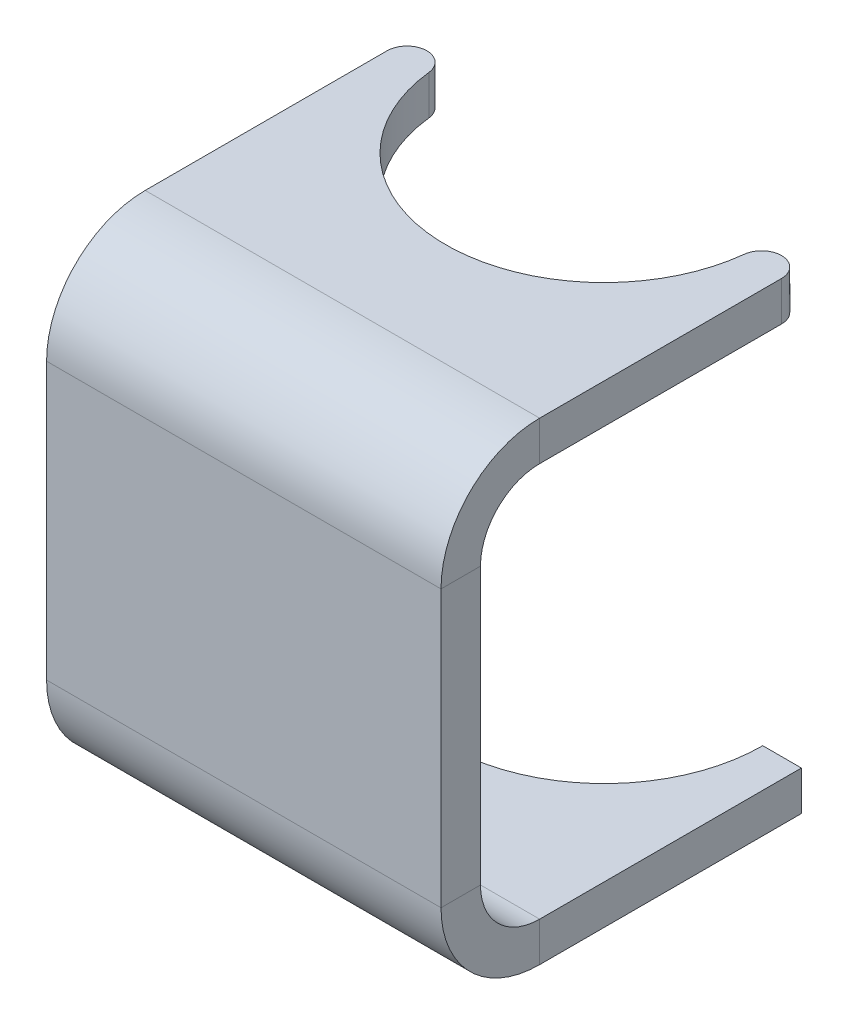
ISO-10303-21;
HEADER;
FILE_DESCRIPTION(('STEP AP214'),'2;1');
FILE_NAME('part.step','',(''),(''),'','','');
FILE_SCHEMA(('AUTOMOTIVE_DESIGN { 1 0 10303 214 1 1 1 1 }'));
ENDSEC;
DATA;
#1=APPLICATION_CONTEXT('core data for automotive mechanical design processes');
#2=APPLICATION_PROTOCOL_DEFINITION('international standard','automotive_design',2000,#1);
#3=PRODUCT_CONTEXT('',#1,'mechanical');
#4=PRODUCT('Part','Part','',(#3));
#5=PRODUCT_RELATED_PRODUCT_CATEGORY('part','',(#4));
#6=PRODUCT_DEFINITION_FORMATION('','',#4);
#7=PRODUCT_DEFINITION_CONTEXT('part definition',#1,'design');
#8=PRODUCT_DEFINITION('design','',#6,#7);
#9=PRODUCT_DEFINITION_SHAPE('','',#8);
#10=(LENGTH_UNIT() NAMED_UNIT(*) SI_UNIT(.MILLI.,.METRE.));
#11=(NAMED_UNIT(*) PLANE_ANGLE_UNIT() SI_UNIT($,.RADIAN.));
#12=(NAMED_UNIT(*) SI_UNIT($,.STERADIAN.) SOLID_ANGLE_UNIT());
#13=UNCERTAINTY_MEASURE_WITH_UNIT(LENGTH_MEASURE(1.E-05),#10,'distance_accuracy_value','');
#14=(GEOMETRIC_REPRESENTATION_CONTEXT(3) GLOBAL_UNCERTAINTY_ASSIGNED_CONTEXT((#13)) GLOBAL_UNIT_ASSIGNED_CONTEXT((#10,
#11,#12)) REPRESENTATION_CONTEXT('',''));
#15=CARTESIAN_POINT('',(0.,0.,0.));
#16=DIRECTION('',(0.,0.,1.));
#17=DIRECTION('',(1.,0.,0.));
#18=AXIS2_PLACEMENT_3D('',#15,#16,#17);
#19=CARTESIAN_POINT('',(15.875,15.5575000000001,-52.8094011308138));
#20=CARTESIAN_POINT('',(15.875,15.6633333333336,-52.8094011308149));
#21=CARTESIAN_POINT('',(15.875,15.7691666666666,-52.8094011306934));
#22=CARTESIAN_POINT('',(15.875,16.9333333333345,-52.8094011307177));
#23=CARTESIAN_POINT('',(15.875,17.991666666664,-52.8094011308602));
#24=CARTESIAN_POINT('',(15.875,19.1558333333337,-52.8094011308844));
#25=CARTESIAN_POINT('',(15.875,19.2616666666665,-52.8094011308818));
#26=CARTESIAN_POINT('',(15.875,19.3675000000001,-52.8094011308829));
#27=CARTESIAN_POINT('',(15.8750000000818,15.5575000000001,-55.6845055560318));
#28=CARTESIAN_POINT('',(15.8750000000809,15.6633333333336,-55.6845055560325));
#29=CARTESIAN_POINT('',(15.8750000002235,15.7691666666663,-55.6845055561596));
#30=CARTESIAN_POINT('',(15.8750000001932,16.9333333333043,-55.6845055561313));
#31=CARTESIAN_POINT('',(15.8750000000289,17.991666666664,-55.6845055559849));
#32=CARTESIAN_POINT('',(15.8749999999986,19.1558333333337,-55.6845055559567));
#33=CARTESIAN_POINT('',(15.8750000000014,19.2616666666665,-55.6845055559581));
#34=CARTESIAN_POINT('',(15.8750000000005,19.3675000000001,-55.6845055559585));
#35=CARTESIAN_POINT('',(13.0043748022879,15.5575000000001,-55.8449313320533));
#36=CARTESIAN_POINT('',(13.0043748022864,15.6633333333336,-55.8449313320537));
#37=CARTESIAN_POINT('',(13.004374802209,15.7691666666663,-55.8449313322153));
#38=CARTESIAN_POINT('',(13.0043748022272,16.9333333333043,-55.844931332183));
#39=CARTESIAN_POINT('',(13.0043748023171,17.9916666666622,-55.8449313319905));
#40=CARTESIAN_POINT('',(13.0043748023342,19.1558333333339,-55.8449313319582));
#41=CARTESIAN_POINT('',(13.004374802332,19.2616666666664,-55.8449313319594));
#42=CARTESIAN_POINT('',(13.0043748023331,19.3675000000001,-55.8449313319601));
#43=CARTESIAN_POINT('',(12.6840231163649,15.5575000000001,-52.9877298597671));
#44=CARTESIAN_POINT('',(12.6840231163649,15.6633333333336,-52.9877298597671));
#45=CARTESIAN_POINT('',(12.6840231163542,15.7691666666666,-52.987729859672));
#46=CARTESIAN_POINT('',(12.6840231163565,16.9333333333345,-52.987729859692));
#47=CARTESIAN_POINT('',(12.6840231163689,17.9916666666622,-52.9877298598028));
#48=CARTESIAN_POINT('',(12.6840231163711,19.1558333333339,-52.9877298598229));
#49=CARTESIAN_POINT('',(12.6840231163708,19.2616666666664,-52.9877298598202));
#50=CARTESIAN_POINT('',(12.684023116371,19.3675000000001,-52.9877298598217));
#51=(BOUNDED_SURFACE() B_SPLINE_SURFACE(3,3,((#19,#20,#21,#22,#23,#24,#25,#26),(#27,#28,#29,#30,
#31,#32,#33,#34),(#35,#36,#37,#38,#39,#40,#41,#42),(#43,#44,#45,#46,#47,#48,#49,#50)),
.UNSPECIFIED.,.F.,.F.,.F.) B_SPLINE_SURFACE_WITH_KNOTS((4,4),(4,2,2,4),(0.,1.),
(-0.0999999999999892,0.,1.,1.1),
.UNSPECIFIED.) GEOMETRIC_REPRESENTATION_ITEM() RATIONAL_B_SPLINE_SURFACE(((1.,1.,1.,1.,1.,1.,1.,
1.),(0.370532162132682,0.370532162132682,0.370532162104608,0.370532162116241,0.370532162148339,
0.370532162148339,0.370532162148506,0.370532162148506),(0.370532162132682,0.370532162132682,
0.370532162104608,0.370532162116241,0.370532162148339,0.370532162148339,0.370532162148506,
0.370532162148506),(1.,1.,1.,1.,1.,1.,1.,1.))) REPRESENTATION_ITEM('') SURFACE());
#52=CARTESIAN_POINT('',(12.6840231163649,15.5575000000001,-52.9877298597671));
#53=CARTESIAN_POINT('',(12.6840231163649,15.6633333333336,-52.9877298597671));
#54=CARTESIAN_POINT('',(12.6840231163542,15.7691666666666,-52.987729859672));
#55=CARTESIAN_POINT('',(12.6840231163565,16.9333333333345,-52.987729859692));
#56=CARTESIAN_POINT('',(12.6840231163689,17.9916666666622,-52.9877298598028));
#57=CARTESIAN_POINT('',(12.6840231163711,19.1558333333339,-52.9877298598229));
#58=CARTESIAN_POINT('',(12.6840231163708,19.2616666666664,-52.9877298598202));
#59=CARTESIAN_POINT('',(12.684023116371,19.3675000000001,-52.9877298598217));
#60=(BOUNDED_CURVE() B_SPLINE_CURVE(3,(#52,#53,#54,#55,#56,#57,#58,#59),.UNSPECIFIED.,.F.,
.F.) B_SPLINE_CURVE_WITH_KNOTS((4,2,2,4),(-0.0999999999999892,0.,1.,1.1),
.UNSPECIFIED.) CURVE() GEOMETRIC_REPRESENTATION_ITEM() RATIONAL_B_SPLINE_CURVE((1.,1.,1.,1.,1.,
1.,1.,1.)) REPRESENTATION_ITEM(''));
#61=CARTESIAN_POINT('',(12.6840231163709,19.0500000000001,-52.9877298598211));
#62=VERTEX_POINT('',#61);
#63=CARTESIAN_POINT('',(12.6840231163544,15.8750000000001,-52.9877298596738));
#64=VERTEX_POINT('',#63);
#65=EDGE_CURVE('E505',#62,#64,#60,.F.);
#66=CARTESIAN_POINT('',(12.6840231163709,19.0500000000001,-52.9877298598211));
#67=CARTESIAN_POINT('',(13.0043748023327,19.0500000000001,-55.8449313319611));
#68=CARTESIAN_POINT('',(15.8750000000013,19.0500000000001,-55.6845055559592));
#69=CARTESIAN_POINT('',(15.875,19.0500000000001,-52.8094011308822));
#70=(BOUNDED_CURVE() B_SPLINE_CURVE(3,(#66,#67,#68,#69),.UNSPECIFIED.,.F.,
.F.) B_SPLINE_CURVE_WITH_KNOTS((4,4),(0.,1.),
.UNSPECIFIED.) CURVE() GEOMETRIC_REPRESENTATION_ITEM() RATIONAL_B_SPLINE_CURVE((1.,
0.370532162148339,0.370532162148339,1.)) REPRESENTATION_ITEM(''));
#71=CARTESIAN_POINT('',(15.875,19.0500000000001,-52.8094011308822));
#72=VERTEX_POINT('',#71);
#73=EDGE_CURVE('E486',#72,#62,#70,.F.);
#74=CARTESIAN_POINT('',(15.875,19.3675000000001,-52.8094011308829));
#75=CARTESIAN_POINT('',(15.875,19.2616666666665,-52.8094011308818));
#76=CARTESIAN_POINT('',(15.875,19.1558333333337,-52.8094011308844));
#77=CARTESIAN_POINT('',(15.875,17.991666666664,-52.8094011308602));
#78=CARTESIAN_POINT('',(15.875,16.9333333333345,-52.8094011307177));
#79=CARTESIAN_POINT('',(15.875,15.7691666666666,-52.8094011306934));
#80=CARTESIAN_POINT('',(15.875,15.6633333333336,-52.8094011308149));
#81=CARTESIAN_POINT('',(15.875,15.5575000000001,-52.8094011308138));
#82=(BOUNDED_CURVE() B_SPLINE_CURVE(3,(#74,#75,#76,#77,#78,#79,#80,#81),.UNSPECIFIED.,.F.,
.F.) B_SPLINE_CURVE_WITH_KNOTS((4,2,2,4),(-0.0999999999999892,0.,1.,1.1),
.UNSPECIFIED.) CURVE() GEOMETRIC_REPRESENTATION_ITEM() RATIONAL_B_SPLINE_CURVE((1.,1.,1.,1.,1.,
1.,1.,1.)) REPRESENTATION_ITEM(''));
#83=CARTESIAN_POINT('',(15.875,15.8750000000001,-52.8094011306956));
#84=VERTEX_POINT('',#83);
#85=EDGE_CURVE('E325',#84,#72,#82,.F.);
#86=CARTESIAN_POINT('',(15.875,15.8750000000001,-52.8094011306956));
#87=CARTESIAN_POINT('',(15.8750000002207,15.8750000000001,-55.684505556157));
#88=CARTESIAN_POINT('',(13.0043748022106,15.8750000000001,-55.8449313322124));
#89=CARTESIAN_POINT('',(12.6840231163544,15.8750000000001,-52.9877298596738));
#90=(BOUNDED_CURVE() B_SPLINE_CURVE(3,(#86,#87,#88,#89),.UNSPECIFIED.,.F.,
.F.) B_SPLINE_CURVE_WITH_KNOTS((4,4),(0.,1.),
.UNSPECIFIED.) CURVE() GEOMETRIC_REPRESENTATION_ITEM() RATIONAL_B_SPLINE_CURVE((1.,
0.370532162105666,0.370532162105666,1.)) REPRESENTATION_ITEM(''));
#91=EDGE_CURVE('E465',#64,#84,#90,.F.);
#92=ORIENTED_EDGE('',*,*,#65,.F.);
#93=ORIENTED_EDGE('',*,*,#73,.F.);
#94=ORIENTED_EDGE('',*,*,#85,.F.);
#95=ORIENTED_EDGE('',*,*,#91,.F.);
#96=EDGE_LOOP('',(#92,#93,#94,#95));
#97=FACE_BOUND('',#96,.T.);
#98=ADVANCED_FACE('F87',(#97),#51,.T.);
#99=CARTESIAN_POINT('',(-15.875,19.3675,-52.8094011308833));
#100=CARTESIAN_POINT('',(-15.875,19.2616666666665,-52.8094011308036));
#101=CARTESIAN_POINT('',(-15.875,19.1558333333337,-52.8094011309626));
#102=CARTESIAN_POINT('',(-15.875,17.991666666664,-52.8094011300902));
#103=CARTESIAN_POINT('',(-15.875,16.9333333333363,-52.8094011239826));
#104=CARTESIAN_POINT('',(-15.875,15.7691666666665,-52.8094011231101));
#105=CARTESIAN_POINT('',(-15.875,15.6633333333347,-52.8094011281098));
#106=CARTESIAN_POINT('',(-15.875,15.5575000000006,-52.8094011280305));
#107=CARTESIAN_POINT('',(-15.875,19.3675000000001,-55.6845055559581));
#108=CARTESIAN_POINT('',(-15.8750000000942,19.2616666666665,-55.6845055560385));
#109=CARTESIAN_POINT('',(-15.8749999999069,19.1558333333233,-55.6845055558736));
#110=CARTESIAN_POINT('',(-15.8750000009308,17.9916666656205,-55.6845055568026));
#111=CARTESIAN_POINT('',(-15.8750000081149,16.9333333323012,-55.6845055632712));
#112=CARTESIAN_POINT('',(-15.8750000091388,15.7691666666561,-55.6845055641962));
#113=CARTESIAN_POINT('',(-15.8750000032605,15.6633333333347,-55.6845055588985));
#114=CARTESIAN_POINT('',(-15.8750000033541,15.5575000000006,-55.6845055589815));
#115=CARTESIAN_POINT('',(-13.0043748023334,19.3675000000001,-55.8449313319596));
#116=CARTESIAN_POINT('',(-13.0043748022836,19.2616666666664,-55.844931332065));
#117=CARTESIAN_POINT('',(-13.0043748023865,19.1558333333235,-55.8449313318535));
#118=CARTESIAN_POINT('',(-13.0043748018019,17.9916666656186,-55.8449313330208));
#119=CARTESIAN_POINT('',(-13.0043747978229,16.9333333323012,-55.8449313412512));
#120=CARTESIAN_POINT('',(-13.0043747972504,15.7691666666561,-55.8449313424265));
#121=CARTESIAN_POINT('',(-13.0043748005173,15.6633333333347,-55.8449313356942));
#122=CARTESIAN_POINT('',(-13.0043748004679,15.5575000000006,-55.8449313358011));
#123=CARTESIAN_POINT('',(-12.684023116371,19.3675,-52.987729859822));
#124=CARTESIAN_POINT('',(-12.6840231163641,19.2616666666664,-52.987729859761));
#125=CARTESIAN_POINT('',(-12.6840231163781,19.1558333333339,-52.9877298598855));
#126=CARTESIAN_POINT('',(-12.6840231162998,17.9916666666622,-52.9877298591868));
#127=CARTESIAN_POINT('',(-12.6840231157603,16.9333333333382,-52.9877298543751));
#128=CARTESIAN_POINT('',(-12.6840231156828,15.7691666666663,-52.9877298536843));
#129=CARTESIAN_POINT('',(-12.6840231161253,15.6633333333348,-52.9877298576304));
#130=CARTESIAN_POINT('',(-12.6840231161184,15.5575000000006,-52.9877298575695));
#131=(BOUNDED_SURFACE() B_SPLINE_SURFACE(3,3,((#99,#100,#101,#102,#103,#104,#105,#106),(#107,
#108,#109,#110,#111,#112,#113,#114),(#115,#116,#117,#118,#119,#120,#121,#122),(#123,#124,#125,
#126,#127,#128,#129,#130)),.UNSPECIFIED.,.F.,.F.,.F.) B_SPLINE_SURFACE_WITH_KNOTS((4,4),(4,2,2,
4),(0.,1.),(-0.0999999999999853,0.,0.999999999999853,1.09999999999984),
.UNSPECIFIED.) GEOMETRIC_REPRESENTATION_ITEM() RATIONAL_B_SPLINE_SURFACE(((1.,1.,1.,1.,1.,1.,1.,
1.),(0.3705321621486,0.3705321621486,0.370532162185136,0.370532161783238,0.370532160751556,
0.37053216035289,0.370532161496201,0.370532161496201),(0.3705321621486,0.3705321621486,
0.370532162185136,0.370532161783238,0.370532160751556,0.37053216035289,0.370532161496201,
0.370532161496201),(1.,1.,1.,1.,1.,1.,1.,1.))) REPRESENTATION_ITEM('') SURFACE());
#132=CARTESIAN_POINT('',(-15.875,15.5575000000006,-52.8094011280305));
#133=CARTESIAN_POINT('',(-15.875,15.6633333333347,-52.8094011281098));
#134=CARTESIAN_POINT('',(-15.875,15.7691666666665,-52.8094011231101));
#135=CARTESIAN_POINT('',(-15.875,16.9333333333363,-52.8094011239826));
#136=CARTESIAN_POINT('',(-15.875,17.991666666664,-52.8094011300902));
#137=CARTESIAN_POINT('',(-15.875,19.1558333333337,-52.8094011309626));
#138=CARTESIAN_POINT('',(-15.875,19.2616666666665,-52.8094011308036));
#139=CARTESIAN_POINT('',(-15.875,19.3675,-52.8094011308833));
#140=(BOUNDED_CURVE() B_SPLINE_CURVE(3,(#132,#133,#134,#135,#136,#137,#138,#139),.UNSPECIFIED.,
.F.,.F.) B_SPLINE_CURVE_WITH_KNOTS((4,2,2,4),(-0.0999999999999852,0.,0.999999999999853,
1.09999999999984),
.UNSPECIFIED.) CURVE() GEOMETRIC_REPRESENTATION_ITEM() RATIONAL_B_SPLINE_CURVE((1.,1.,1.,1.,1.,
1.,1.,1.)) REPRESENTATION_ITEM(''));
#141=CARTESIAN_POINT('',(-15.875,19.0500000000001,-52.8094011308833));
#142=VERTEX_POINT('',#141);
#143=CARTESIAN_POINT('',(-15.875,15.8750000000001,-52.8094011231894));
#144=VERTEX_POINT('',#143);
#145=EDGE_CURVE('E233',#142,#144,#140,.F.);
#146=CARTESIAN_POINT('',(-15.875,19.0500000000001,-52.8094011308833));
#147=CARTESIAN_POINT('',(-15.875,19.0500000000001,-55.6845055559581));
#148=CARTESIAN_POINT('',(-13.0043748023334,19.0500000000001,-55.8449313319596));
#149=CARTESIAN_POINT('',(-12.684023116371,19.0500000000001,-52.987729859822));
#150=(BOUNDED_CURVE() B_SPLINE_CURVE(3,(#146,#147,#148,#149),.UNSPECIFIED.,.F.,
.F.) B_SPLINE_CURVE_WITH_KNOTS((4,4),(0.,1.),
.UNSPECIFIED.) CURVE() GEOMETRIC_REPRESENTATION_ITEM() RATIONAL_B_SPLINE_CURVE((1.,
0.3705321621486,0.3705321621486,1.)) REPRESENTATION_ITEM(''));
#151=CARTESIAN_POINT('',(-12.684023116371,19.0500000000001,-52.987729859822));
#152=VERTEX_POINT('',#151);
#153=EDGE_CURVE('E536',#152,#142,#150,.F.);
#154=CARTESIAN_POINT('',(-12.684023116371,19.3675,-52.987729859822));
#155=CARTESIAN_POINT('',(-12.6840231163641,19.2616666666664,-52.987729859761));
#156=CARTESIAN_POINT('',(-12.6840231163781,19.1558333333339,-52.9877298598855));
#157=CARTESIAN_POINT('',(-12.6840231162998,17.9916666666622,-52.9877298591868));
#158=CARTESIAN_POINT('',(-12.6840231157603,16.9333333333382,-52.9877298543751));
#159=CARTESIAN_POINT('',(-12.6840231156828,15.7691666666663,-52.9877298536843));
#160=CARTESIAN_POINT('',(-12.6840231161253,15.6633333333348,-52.9877298576304));
#161=CARTESIAN_POINT('',(-12.6840231161184,15.5575000000006,-52.9877298575695));
#162=(BOUNDED_CURVE() B_SPLINE_CURVE(3,(#154,#155,#156,#157,#158,#159,#160,#161),.UNSPECIFIED.,
.F.,.F.) B_SPLINE_CURVE_WITH_KNOTS((4,2,2,4),(-0.0999999999999853,0.,0.999999999999853,
1.09999999999984),
.UNSPECIFIED.) CURVE() GEOMETRIC_REPRESENTATION_ITEM() RATIONAL_B_SPLINE_CURVE((1.,1.,1.,1.,1.,
1.,1.,1.)) REPRESENTATION_ITEM(''));
#163=CARTESIAN_POINT('',(-12.6840231156899,15.8750000000001,-52.9877298537471));
#164=VERTEX_POINT('',#163);
#165=EDGE_CURVE('E540',#164,#152,#162,.F.);
#166=CARTESIAN_POINT('',(-12.6840231156899,15.8750000000001,-52.9877298537471));
#167=CARTESIAN_POINT('',(-13.0043747973025,15.8750000000001,-55.8449313423197));
#168=CARTESIAN_POINT('',(-15.8750000090457,15.8750000000001,-55.6845055641121));
#169=CARTESIAN_POINT('',(-15.875,15.8750000000001,-52.8094011231894));
#170=(BOUNDED_CURVE() B_SPLINE_CURVE(3,(#166,#167,#168,#169),.UNSPECIFIED.,.F.,
.F.) B_SPLINE_CURVE_WITH_KNOTS((4,4),(0.,1.),
.UNSPECIFIED.) CURVE() GEOMETRIC_REPRESENTATION_ITEM() RATIONAL_B_SPLINE_CURVE((1.,
0.370532160389132,0.370532160389132,1.)) REPRESENTATION_ITEM(''));
#171=EDGE_CURVE('E420',#144,#164,#170,.F.);
#172=ORIENTED_EDGE('',*,*,#145,.F.);
#173=ORIENTED_EDGE('',*,*,#153,.F.);
#174=ORIENTED_EDGE('',*,*,#165,.F.);
#175=ORIENTED_EDGE('',*,*,#171,.F.);
#176=EDGE_LOOP('',(#172,#173,#174,#175));
#177=FACE_BOUND('',#176,.T.);
#178=ADVANCED_FACE('F377',(#177),#131,.T.);
#179=CARTESIAN_POINT('',(-15.875,-19.0500000000001,-54.409872550752));
#180=DIRECTION('',(1.,0.,0.));
#181=DIRECTION('',(0.,0.,-1.));
#182=AXIS2_PLACEMENT_3D('',#179,#180,#181);
#183=PLANE('',#182);
#184=DIRECTION('',(0.,0.,1.));
#185=VECTOR('',#184,1.);
#186=CARTESIAN_POINT('',(-15.875,-15.8750000000001,-54.409872550752));
#187=LINE('',#186,#185);
#188=CARTESIAN_POINT('',(-15.875,-15.875,-33.3375));
#189=VERTEX_POINT('',#188);
#190=CARTESIAN_POINT('',(-15.875,-15.875,-42.734859778292));
#191=VERTEX_POINT('',#190);
#192=EDGE_CURVE('E252',#189,#191,#187,.F.);
#193=ORIENTED_EDGE('',*,*,#192,.T.);
#194=DIRECTION('',(0.,1.,0.));
#195=VECTOR('',#194,1.);
#196=CARTESIAN_POINT('',(-15.875,-19.0500000000001,-42.734859778292));
#197=LINE('',#196,#195);
#198=CARTESIAN_POINT('',(-15.875,-19.0500000000001,-42.734859778292));
#199=VERTEX_POINT('',#198);
#200=EDGE_CURVE('E95',#191,#199,#197,.F.);
#201=ORIENTED_EDGE('',*,*,#200,.T.);
#202=DIRECTION('',(0.,0.,-1.));
#203=VECTOR('',#202,1.);
#204=CARTESIAN_POINT('',(-15.875,-19.0499999999999,0.));
#205=LINE('',#204,#203);
#206=CARTESIAN_POINT('',(-15.875,-19.05,-33.3375));
#207=VERTEX_POINT('',#206);
#208=EDGE_CURVE('E241',#207,#199,#205,.T.);
#209=ORIENTED_EDGE('',*,*,#208,.F.);
#210=DIRECTION('',(0.,1.,0.));
#211=VECTOR('',#210,1.);
#212=CARTESIAN_POINT('',(-15.875,-15.875,-33.3375));
#213=LINE('',#212,#211);
#214=EDGE_CURVE('E256',#189,#207,#213,.F.);
#215=ORIENTED_EDGE('',*,*,#214,.F.);
#216=EDGE_LOOP('',(#193,#201,#209,#215));
#217=FACE_BOUND('',#216,.T.);
#218=ADVANCED_FACE('F385',(#217),#183,.F.);
#219=CARTESIAN_POINT('',(0.,-19.0499999999999,0.));
#220=DIRECTION('',(0.,1.,0.));
#221=DIRECTION('',(0.,0.,1.));
#222=AXIS2_PLACEMENT_3D('',#219,#220,#221);
#223=PLANE('',#222);
#224=ORIENTED_EDGE('',*,*,#208,.T.);
#225=CARTESIAN_POINT('',(-12.7,-19.0500000000001,-42.734859778292));
#226=DIRECTION('',(0.,1.,0.));
#227=DIRECTION('',(0.,0.,1.));
#228=AXIS2_PLACEMENT_3D('',#225,#226,#227);
#229=CIRCLE('',#228,3.175);
#230=CARTESIAN_POINT('',(-11.8725790743011,-19.0500000000001,-45.800149260823));
#231=VERTEX_POINT('',#230);
#232=EDGE_CURVE('E13',#199,#231,#229,.F.);
#233=ORIENTED_EDGE('',*,*,#232,.T.);
#234=CARTESIAN_POINT('',(28.8557432970434,-19.0500000000001,-52.3847993097249));
#235=DIRECTION('',(0.,-1.,0.));
#236=DIRECTION('',(0.997546498443056,0.,0.0700070242475595));
#237=AXIS2_PLACEMENT_3D('',#234,#235,#236);
#238=ELLIPSE('',#237,59.5271381209999,12.7635);
#239=CARTESIAN_POINT('',(-9.30610695920043,-19.0500000000001,-45.1367671516875));
#240=VERTEX_POINT('',#239);
#241=EDGE_CURVE('E600',#240,#231,#238,.T.);
#242=ORIENTED_EDGE('',*,*,#241,.F.);
#243=CARTESIAN_POINT('',(-10.0692005536845,-19.05,-42.0548338029504));
#244=DIRECTION('',(0.,1.,0.));
#245=DIRECTION('',(0.,0.,1.));
#246=AXIS2_PLACEMENT_3D('',#243,#244,#245);
#247=CIRCLE('',#246,3.175);
#248=CARTESIAN_POINT('',(-8.06338371032102,-19.0500000000001,-44.5159969001221));
#249=VERTEX_POINT('',#248);
#250=EDGE_CURVE('E220',#240,#249,#247,.F.);
#251=ORIENTED_EDGE('',*,*,#250,.T.);
#252=CARTESIAN_POINT('',(0.,-19.0500000000001,-54.4098725507521));
#253=DIRECTION('',(0.,1.,0.));
#254=DIRECTION('',(0.,0.,1.));
#255=AXIS2_PLACEMENT_3D('',#252,#253,#254);
#256=CIRCLE('',#255,12.7635);
#257=CARTESIAN_POINT('',(12.7635,-19.0500000000001,-54.409872550752));
#258=VERTEX_POINT('',#257);
#259=EDGE_CURVE('E211',#249,#258,#256,.T.);
#260=ORIENTED_EDGE('',*,*,#259,.T.);
#261=DIRECTION('',(1.,0.,0.));
#262=VECTOR('',#261,1.);
#263=CARTESIAN_POINT('',(0.,-19.0500000000001,-54.409872550752));
#264=LINE('',#263,#262);
#265=CARTESIAN_POINT('',(15.875,-19.0500000000001,-54.409872550752));
#266=VERTEX_POINT('',#265);
#267=EDGE_CURVE('E216',#258,#266,#264,.T.);
#268=ORIENTED_EDGE('',*,*,#267,.T.);
#269=DIRECTION('',(0.,0.,1.));
#270=VECTOR('',#269,1.);
#271=CARTESIAN_POINT('',(15.875,-19.0499999999999,0.));
#272=LINE('',#271,#270);
#273=CARTESIAN_POINT('',(15.875,-19.05,-33.3375));
#274=VERTEX_POINT('',#273);
#275=EDGE_CURVE('E240',#266,#274,#272,.T.);
#276=ORIENTED_EDGE('',*,*,#275,.T.);
#277=DIRECTION('',(-1.,0.,0.));
#278=VECTOR('',#277,1.);
#279=CARTESIAN_POINT('',(15.875,-19.05,-33.3375));
#280=LINE('',#279,#278);
#281=EDGE_CURVE('E254',#207,#274,#280,.F.);
#282=ORIENTED_EDGE('',*,*,#281,.F.);
#283=EDGE_LOOP('',(#224,#233,#242,#251,#260,#268,#276,#282));
#284=FACE_BOUND('',#283,.T.);
#285=ADVANCED_FACE('F213',(#284),#223,.F.);
#286=CARTESIAN_POINT('',(0.,-15.8749999999999,0.));
#287=DIRECTION('',(0.,1.,0.));
#288=DIRECTION('',(0.,0.,1.));
#289=AXIS2_PLACEMENT_3D('',#286,#287,#288);
#290=PLANE('',#289);
#291=CARTESIAN_POINT('',(28.8557432970434,-15.8750000000001,-52.3847993097249));
#292=DIRECTION('',(0.,-1.,0.));
#293=DIRECTION('',(0.997546498443056,0.,0.0700070242475595));
#294=AXIS2_PLACEMENT_3D('',#291,#292,#293);
#295=ELLIPSE('',#294,59.5271381209999,12.7635);
#296=CARTESIAN_POINT('',(-9.30610695920043,-15.8750000000001,-45.1367671516875));
#297=VERTEX_POINT('',#296);
#298=CARTESIAN_POINT('',(-11.8725790743011,-15.8750000000001,-45.8001492608231));
#299=VERTEX_POINT('',#298);
#300=EDGE_CURVE('E599',#297,#299,#295,.T.);
#301=ORIENTED_EDGE('',*,*,#300,.T.);
#302=CARTESIAN_POINT('',(-12.7,-15.875,-42.734859778292));
#303=DIRECTION('',(0.,1.,0.));
#304=DIRECTION('',(0.,0.,1.));
#305=AXIS2_PLACEMENT_3D('',#302,#303,#304);
#306=CIRCLE('',#305,3.175);
#307=EDGE_CURVE('E109',#299,#191,#306,.T.);
#308=ORIENTED_EDGE('',*,*,#307,.T.);
#309=ORIENTED_EDGE('',*,*,#192,.F.);
#310=DIRECTION('',(-1.,0.,0.));
#311=VECTOR('',#310,1.);
#312=CARTESIAN_POINT('',(15.875,-15.875,-33.3375));
#313=LINE('',#312,#311);
#314=CARTESIAN_POINT('',(15.875,-15.875,-33.3375));
#315=VERTEX_POINT('',#314);
#316=EDGE_CURVE('E259',#315,#189,#313,.T.);
#317=ORIENTED_EDGE('',*,*,#316,.F.);
#318=DIRECTION('',(0.,0.,-1.));
#319=VECTOR('',#318,1.);
#320=CARTESIAN_POINT('',(15.875,-15.875,-28.575));
#321=LINE('',#320,#319);
#322=CARTESIAN_POINT('',(15.875,-15.8750000000001,-54.409872550752));
#323=VERTEX_POINT('',#322);
#324=EDGE_CURVE('E244',#323,#315,#321,.F.);
#325=ORIENTED_EDGE('',*,*,#324,.F.);
#326=DIRECTION('',(-1.,0.,0.));
#327=VECTOR('',#326,1.);
#328=CARTESIAN_POINT('',(15.875,-15.8750000000001,-54.409872550752));
#329=LINE('',#328,#327);
#330=CARTESIAN_POINT('',(12.7635,-15.8750000000001,-54.409872550752));
#331=VERTEX_POINT('',#330);
#332=EDGE_CURVE('E250',#331,#323,#329,.F.);
#333=ORIENTED_EDGE('',*,*,#332,.F.);
#334=CARTESIAN_POINT('',(0.,-15.8750000000001,-54.4098725507521));
#335=DIRECTION('',(0.,1.,0.));
#336=DIRECTION('',(0.,0.,1.));
#337=AXIS2_PLACEMENT_3D('',#334,#335,#336);
#338=CIRCLE('',#337,12.7635);
#339=CARTESIAN_POINT('',(-8.06338371032103,-15.8750000000001,-44.5159969001221));
#340=VERTEX_POINT('',#339);
#341=EDGE_CURVE('E224',#340,#331,#338,.T.);
#342=ORIENTED_EDGE('',*,*,#341,.F.);
#343=CARTESIAN_POINT('',(-10.0692005536845,-15.875,-42.0548338029504));
#344=DIRECTION('',(0.,1.,0.));
#345=DIRECTION('',(0.,0.,1.));
#346=AXIS2_PLACEMENT_3D('',#343,#344,#345);
#347=CIRCLE('',#346,3.175);
#348=EDGE_CURVE('E461',#340,#297,#347,.T.);
#349=ORIENTED_EDGE('',*,*,#348,.T.);
#350=EDGE_LOOP('',(#301,#308,#309,#317,#325,#333,#342,#349));
#351=FACE_BOUND('',#350,.T.);
#352=ADVANCED_FACE('F437',(#351),#290,.T.);
#353=CARTESIAN_POINT('',(0.,-19.0500000000001,-54.4098725507521));
#354=DIRECTION('',(0.,1.,0.));
#355=DIRECTION('',(0.,0.,1.));
#356=AXIS2_PLACEMENT_3D('',#353,#354,#355);
#357=CYLINDRICAL_SURFACE('',#356,12.7635);
#358=ORIENTED_EDGE('',*,*,#259,.F.);
#359=DIRECTION('',(0.,1.,0.));
#360=VECTOR('',#359,1.);
#361=CARTESIAN_POINT('',(-8.06338371032103,-19.0500000000001,-44.5159969001221));
#362=LINE('',#361,#360);
#363=EDGE_CURVE('E463',#249,#340,#362,.T.);
#364=ORIENTED_EDGE('',*,*,#363,.T.);
#365=ORIENTED_EDGE('',*,*,#341,.T.);
#366=DIRECTION('',(0.,1.,0.));
#367=VECTOR('',#366,1.);
#368=CARTESIAN_POINT('',(12.7635,-19.0500000000001,-54.409872550752));
#369=LINE('',#368,#367);
#370=EDGE_CURVE('E228',#258,#331,#369,.T.);
#371=ORIENTED_EDGE('',*,*,#370,.F.);
#372=EDGE_LOOP('',(#358,#364,#365,#371));
#373=FACE_BOUND('',#372,.T.);
#374=ADVANCED_FACE('F229',(#373),#357,.F.);
#375=CARTESIAN_POINT('',(15.875,-19.0500000000001,-54.409872550752));
#376=DIRECTION('',(0.,0.,1.));
#377=DIRECTION('',(0.,-1.,0.));
#378=AXIS2_PLACEMENT_3D('',#375,#376,#377);
#379=PLANE('',#378);
#380=ORIENTED_EDGE('',*,*,#267,.F.);
#381=ORIENTED_EDGE('',*,*,#370,.T.);
#382=ORIENTED_EDGE('',*,*,#332,.T.);
#383=DIRECTION('',(0.,1.,0.));
#384=VECTOR('',#383,1.);
#385=CARTESIAN_POINT('',(15.875,-19.0500000000001,-54.409872550752));
#386=LINE('',#385,#384);
#387=EDGE_CURVE('E238',#266,#323,#386,.T.);
#388=ORIENTED_EDGE('',*,*,#387,.F.);
#389=EDGE_LOOP('',(#380,#381,#382,#388));
#390=FACE_BOUND('',#389,.T.);
#391=ADVANCED_FACE('F236',(#390),#379,.F.);
#392=CARTESIAN_POINT('',(0.,0.,-28.575));
#393=DIRECTION('',(0.,0.,-1.));
#394=DIRECTION('',(-1.,0.,0.));
#395=AXIS2_PLACEMENT_3D('',#392,#393,#394);
#396=PLANE('',#395);
#397=DIRECTION('',(0.,1.,0.));
#398=VECTOR('',#397,1.);
#399=CARTESIAN_POINT('',(15.875,-19.05,-28.575));
#400=LINE('',#399,#398);
#401=CARTESIAN_POINT('',(15.875,-11.1125,-28.575));
#402=VERTEX_POINT('',#401);
#403=CARTESIAN_POINT('',(15.875,11.1125,-28.575));
#404=VERTEX_POINT('',#403);
#405=EDGE_CURVE('E234',#402,#404,#400,.T.);
#406=ORIENTED_EDGE('',*,*,#405,.F.);
#407=DIRECTION('',(-1.,0.,0.));
#408=VECTOR('',#407,1.);
#409=CARTESIAN_POINT('',(-15.875,-11.1125,-28.575));
#410=LINE('',#409,#408);
#411=CARTESIAN_POINT('',(-15.875,-11.1125,-28.575));
#412=VERTEX_POINT('',#411);
#413=EDGE_CURVE('E277',#412,#402,#410,.F.);
#414=ORIENTED_EDGE('',*,*,#413,.F.);
#415=DIRECTION('',(0.,-1.,0.));
#416=VECTOR('',#415,1.);
#417=CARTESIAN_POINT('',(-15.875,-19.05,-28.575));
#418=LINE('',#417,#416);
#419=CARTESIAN_POINT('',(-15.875,11.1125,-28.575));
#420=VERTEX_POINT('',#419);
#421=EDGE_CURVE('E577',#420,#412,#418,.T.);
#422=ORIENTED_EDGE('',*,*,#421,.F.);
#423=DIRECTION('',(1.,0.,0.));
#424=VECTOR('',#423,1.);
#425=CARTESIAN_POINT('',(15.875,11.1125,-28.575));
#426=LINE('',#425,#424);
#427=EDGE_CURVE('E570',#404,#420,#426,.F.);
#428=ORIENTED_EDGE('',*,*,#427,.F.);
#429=EDGE_LOOP('',(#406,#414,#422,#428));
#430=FACE_BOUND('',#429,.T.);
#431=ADVANCED_FACE('F361',(#430),#396,.T.);
#432=CARTESIAN_POINT('',(0.,0.,-25.4));
#433=DIRECTION('',(0.,0.,-1.));
#434=DIRECTION('',(-1.,0.,0.));
#435=AXIS2_PLACEMENT_3D('',#432,#433,#434);
#436=PLANE('',#435);
#437=DIRECTION('',(-1.,0.,0.));
#438=VECTOR('',#437,1.);
#439=CARTESIAN_POINT('',(-15.875,-11.1125,-25.4));
#440=LINE('',#439,#438);
#441=CARTESIAN_POINT('',(-15.875,-11.1125,-25.4));
#442=VERTEX_POINT('',#441);
#443=CARTESIAN_POINT('',(15.875,-11.1125,-25.4));
#444=VERTEX_POINT('',#443);
#445=EDGE_CURVE('E265',#442,#444,#440,.F.);
#446=ORIENTED_EDGE('',*,*,#445,.T.);
#447=DIRECTION('',(0.,1.,0.));
#448=VECTOR('',#447,1.);
#449=CARTESIAN_POINT('',(15.875,-19.05,-25.4));
#450=LINE('',#449,#448);
#451=CARTESIAN_POINT('',(15.875,11.1125,-25.4));
#452=VERTEX_POINT('',#451);
#453=EDGE_CURVE('E580',#444,#452,#450,.T.);
#454=ORIENTED_EDGE('',*,*,#453,.T.);
#455=DIRECTION('',(1.,0.,0.));
#456=VECTOR('',#455,1.);
#457=CARTESIAN_POINT('',(15.875,11.1125,-25.4));
#458=LINE('',#457,#456);
#459=CARTESIAN_POINT('',(-15.875,11.1125,-25.4));
#460=VERTEX_POINT('',#459);
#461=EDGE_CURVE('E561',#452,#460,#458,.F.);
#462=ORIENTED_EDGE('',*,*,#461,.T.);
#463=DIRECTION('',(0.,-1.,0.));
#464=VECTOR('',#463,1.);
#465=CARTESIAN_POINT('',(-15.875,-19.05,-25.4));
#466=LINE('',#465,#464);
#467=EDGE_CURVE('E575',#460,#442,#466,.T.);
#468=ORIENTED_EDGE('',*,*,#467,.T.);
#469=EDGE_LOOP('',(#446,#454,#462,#468));
#470=FACE_BOUND('',#469,.T.);
#471=ADVANCED_FACE('F364',(#470),#436,.F.);
#472=CARTESIAN_POINT('',(-15.875,-19.05,-28.575));
#473=DIRECTION('',(-1.,0.,0.));
#474=DIRECTION('',(0.,0.,1.));
#475=AXIS2_PLACEMENT_3D('',#472,#473,#474);
#476=PLANE('',#475);
#477=ORIENTED_EDGE('',*,*,#421,.T.);
#478=DIRECTION('',(0.,0.,1.));
#479=VECTOR('',#478,1.);
#480=CARTESIAN_POINT('',(-15.875,-11.1125,-28.575));
#481=LINE('',#480,#479);
#482=EDGE_CURVE('E271',#412,#442,#481,.T.);
#483=ORIENTED_EDGE('',*,*,#482,.T.);
#484=ORIENTED_EDGE('',*,*,#467,.F.);
#485=DIRECTION('',(0.,0.,1.));
#486=VECTOR('',#485,1.);
#487=CARTESIAN_POINT('',(-15.875,11.1125,-28.575));
#488=LINE('',#487,#486);
#489=EDGE_CURVE('E559',#420,#460,#488,.T.);
#490=ORIENTED_EDGE('',*,*,#489,.F.);
#491=EDGE_LOOP('',(#477,#483,#484,#490));
#492=FACE_BOUND('',#491,.T.);
#493=ADVANCED_FACE('F368',(#492),#476,.T.);
#494=CARTESIAN_POINT('',(15.875,-19.05,-28.575));
#495=DIRECTION('',(1.,0.,0.));
#496=DIRECTION('',(0.,0.,-1.));
#497=AXIS2_PLACEMENT_3D('',#494,#495,#496);
#498=PLANE('',#497);
#499=DIRECTION('',(0.,0.,1.));
#500=VECTOR('',#499,1.);
#501=CARTESIAN_POINT('',(15.875,-11.1125,-28.575));
#502=LINE('',#501,#500);
#503=EDGE_CURVE('E283',#402,#444,#502,.T.);
#504=ORIENTED_EDGE('',*,*,#503,.F.);
#505=ORIENTED_EDGE('',*,*,#405,.T.);
#506=DIRECTION('',(0.,0.,1.));
#507=VECTOR('',#506,1.);
#508=CARTESIAN_POINT('',(15.875,11.1125,-28.575));
#509=LINE('',#508,#507);
#510=EDGE_CURVE('E560',#404,#452,#509,.T.);
#511=ORIENTED_EDGE('',*,*,#510,.T.);
#512=ORIENTED_EDGE('',*,*,#453,.F.);
#513=EDGE_LOOP('',(#504,#505,#511,#512));
#514=FACE_BOUND('',#513,.T.);
#515=ADVANCED_FACE('F356',(#514),#498,.T.);
#516=CARTESIAN_POINT('',(-15.875,11.1125,-33.3375));
#517=DIRECTION('',(-1.,0.,0.));
#518=DIRECTION('',(0.,0.,1.));
#519=AXIS2_PLACEMENT_3D('',#516,#517,#518);
#520=PLANE('',#519);
#521=DIRECTION('',(0.,-1.,0.));
#522=VECTOR('',#521,1.);
#523=CARTESIAN_POINT('',(-15.875,19.05,-33.3375));
#524=LINE('',#523,#522);
#525=CARTESIAN_POINT('',(-15.875,15.875,-33.3375));
#526=VERTEX_POINT('',#525);
#527=CARTESIAN_POINT('',(-15.875,19.05,-33.3375));
#528=VERTEX_POINT('',#527);
#529=EDGE_CURVE('E286',#526,#528,#524,.F.);
#530=ORIENTED_EDGE('',*,*,#529,.F.);
#531=CARTESIAN_POINT('',(-15.875,11.1125,-33.3375));
#532=DIRECTION('',(1.,0.,0.));
#533=DIRECTION('',(0.,0.,-1.));
#534=AXIS2_PLACEMENT_3D('',#531,#532,#533);
#535=CIRCLE('',#534,4.7625);
#536=EDGE_CURVE('E568',#420,#526,#535,.F.);
#537=ORIENTED_EDGE('',*,*,#536,.F.);
#538=ORIENTED_EDGE('',*,*,#489,.T.);
#539=CARTESIAN_POINT('',(-15.875,11.1125,-33.3375));
#540=DIRECTION('',(1.,0.,0.));
#541=DIRECTION('',(0.,0.,-1.));
#542=AXIS2_PLACEMENT_3D('',#539,#540,#541);
#543=CIRCLE('',#542,7.9375);
#544=EDGE_CURVE('E551',#460,#528,#543,.F.);
#545=ORIENTED_EDGE('',*,*,#544,.T.);
#546=EDGE_LOOP('',(#530,#537,#538,#545));
#547=FACE_BOUND('',#546,.T.);
#548=ADVANCED_FACE('F353',(#547),#520,.T.);
#549=CARTESIAN_POINT('',(15.875,11.1125,-33.3375));
#550=DIRECTION('',(-1.,0.,0.));
#551=DIRECTION('',(0.,0.,1.));
#552=AXIS2_PLACEMENT_3D('',#549,#550,#551);
#553=PLANE('',#552);
#554=CARTESIAN_POINT('',(15.875,11.1125,-33.3375));
#555=DIRECTION('',(1.,0.,0.));
#556=DIRECTION('',(0.,0.,-1.));
#557=AXIS2_PLACEMENT_3D('',#554,#555,#556);
#558=CIRCLE('',#557,4.7625);
#559=CARTESIAN_POINT('',(15.875,15.875,-33.3375));
#560=VERTEX_POINT('',#559);
#561=EDGE_CURVE('E296',#560,#404,#558,.T.);
#562=ORIENTED_EDGE('',*,*,#561,.F.);
#563=DIRECTION('',(0.,-1.,0.));
#564=VECTOR('',#563,1.);
#565=CARTESIAN_POINT('',(15.875,15.875,-33.3375));
#566=LINE('',#565,#564);
#567=CARTESIAN_POINT('',(15.875,19.05,-33.3375));
#568=VERTEX_POINT('',#567);
#569=EDGE_CURVE('E555',#560,#568,#566,.F.);
#570=ORIENTED_EDGE('',*,*,#569,.T.);
#571=CARTESIAN_POINT('',(15.875,11.1125,-33.3375));
#572=DIRECTION('',(1.,0.,0.));
#573=DIRECTION('',(0.,0.,-1.));
#574=AXIS2_PLACEMENT_3D('',#571,#572,#573);
#575=CIRCLE('',#574,7.9375);
#576=EDGE_CURVE('E553',#568,#452,#575,.T.);
#577=ORIENTED_EDGE('',*,*,#576,.T.);
#578=ORIENTED_EDGE('',*,*,#510,.F.);
#579=EDGE_LOOP('',(#562,#570,#577,#578));
#580=FACE_BOUND('',#579,.T.);
#581=ADVANCED_FACE('F348',(#580),#553,.F.);
#582=CARTESIAN_POINT('',(15.875,11.1125,-33.3375));
#583=DIRECTION('',(1.,0.,0.));
#584=DIRECTION('',(0.,1.,0.));
#585=AXIS2_PLACEMENT_3D('',#582,#583,#584);
#586=CYLINDRICAL_SURFACE('',#585,7.9375);
#587=ORIENTED_EDGE('',*,*,#461,.F.);
#588=ORIENTED_EDGE('',*,*,#576,.F.);
#589=DIRECTION('',(1.,0.,0.));
#590=VECTOR('',#589,1.);
#591=CARTESIAN_POINT('',(-15.875,19.05,-33.3375));
#592=LINE('',#591,#590);
#593=EDGE_CURVE('E308',#568,#528,#592,.F.);
#594=ORIENTED_EDGE('',*,*,#593,.T.);
#595=ORIENTED_EDGE('',*,*,#544,.F.);
#596=EDGE_LOOP('',(#587,#588,#594,#595));
#597=FACE_BOUND('',#596,.T.);
#598=ADVANCED_FACE('F345',(#597),#586,.T.);
#599=CARTESIAN_POINT('',(15.875,11.1125,-33.3375));
#600=DIRECTION('',(1.,0.,0.));
#601=DIRECTION('',(0.,1.,0.));
#602=AXIS2_PLACEMENT_3D('',#599,#600,#601);
#603=CYLINDRICAL_SURFACE('',#602,4.7625);
#604=ORIENTED_EDGE('',*,*,#427,.T.);
#605=ORIENTED_EDGE('',*,*,#536,.T.);
#606=DIRECTION('',(1.,0.,0.));
#607=VECTOR('',#606,1.);
#608=CARTESIAN_POINT('',(-15.875,15.875,-33.3375));
#609=LINE('',#608,#607);
#610=EDGE_CURVE('E590',#526,#560,#609,.T.);
#611=ORIENTED_EDGE('',*,*,#610,.T.);
#612=ORIENTED_EDGE('',*,*,#561,.T.);
#613=EDGE_LOOP('',(#604,#605,#611,#612));
#614=FACE_BOUND('',#613,.T.);
#615=ADVANCED_FACE('F342',(#614),#603,.F.);
#616=CARTESIAN_POINT('',(15.875,19.0500000000001,-54.409872550752));
#617=DIRECTION('',(-1.,0.,0.));
#618=DIRECTION('',(0.,0.,1.));
#619=AXIS2_PLACEMENT_3D('',#616,#617,#618);
#620=PLANE('',#619);
#621=DIRECTION('',(0.,0.,1.));
#622=VECTOR('',#621,1.);
#623=CARTESIAN_POINT('',(15.875,15.8750000000001,-54.409872550752));
#624=LINE('',#623,#622);
#625=EDGE_CURVE('E301',#560,#84,#624,.F.);
#626=ORIENTED_EDGE('',*,*,#625,.T.);
#627=ORIENTED_EDGE('',*,*,#85,.T.);
#628=DIRECTION('',(0.,0.,-1.));
#629=VECTOR('',#628,1.);
#630=CARTESIAN_POINT('',(15.875,19.0499999999999,0.));
#631=LINE('',#630,#629);
#632=EDGE_CURVE('E297',#568,#72,#631,.T.);
#633=ORIENTED_EDGE('',*,*,#632,.F.);
#634=ORIENTED_EDGE('',*,*,#569,.F.);
#635=EDGE_LOOP('',(#626,#627,#633,#634));
#636=FACE_BOUND('',#635,.T.);
#637=ADVANCED_FACE('F331',(#636),#620,.F.);
#638=CARTESIAN_POINT('',(-15.875,19.05,-28.575));
#639=DIRECTION('',(1.,0.,0.));
#640=DIRECTION('',(0.,0.,-1.));
#641=AXIS2_PLACEMENT_3D('',#638,#639,#640);
#642=PLANE('',#641);
#643=DIRECTION('',(0.,0.,1.));
#644=VECTOR('',#643,1.);
#645=CARTESIAN_POINT('',(-15.875,19.0499999999999,0.));
#646=LINE('',#645,#644);
#647=EDGE_CURVE('E294',#142,#528,#646,.T.);
#648=ORIENTED_EDGE('',*,*,#647,.F.);
#649=ORIENTED_EDGE('',*,*,#145,.T.);
#650=DIRECTION('',(0.,0.,-1.));
#651=VECTOR('',#650,1.);
#652=CARTESIAN_POINT('',(-15.875,15.875,-28.575));
#653=LINE('',#652,#651);
#654=EDGE_CURVE('E299',#144,#526,#653,.F.);
#655=ORIENTED_EDGE('',*,*,#654,.T.);
#656=ORIENTED_EDGE('',*,*,#529,.T.);
#657=EDGE_LOOP('',(#648,#649,#655,#656));
#658=FACE_BOUND('',#657,.T.);
#659=ADVANCED_FACE('F341',(#658),#642,.F.);
#660=CARTESIAN_POINT('',(0.,19.0499999999999,0.));
#661=DIRECTION('',(0.,-1.,0.));
#662=DIRECTION('',(0.,0.,-1.));
#663=AXIS2_PLACEMENT_3D('',#660,#661,#662);
#664=PLANE('',#663);
#665=ORIENTED_EDGE('',*,*,#632,.T.);
#666=ORIENTED_EDGE('',*,*,#73,.T.);
#667=CARTESIAN_POINT('',(0.,19.0500000000001,-54.4098725507521));
#668=DIRECTION('',(0.,1.,0.));
#669=DIRECTION('',(0.,0.,1.));
#670=AXIS2_PLACEMENT_3D('',#667,#668,#669);
#671=CIRCLE('',#670,12.7635);
#672=EDGE_CURVE('E225',#152,#62,#671,.T.);
#673=ORIENTED_EDGE('',*,*,#672,.F.);
#674=ORIENTED_EDGE('',*,*,#153,.T.);
#675=ORIENTED_EDGE('',*,*,#647,.T.);
#676=ORIENTED_EDGE('',*,*,#593,.F.);
#677=EDGE_LOOP('',(#665,#666,#673,#674,#675,#676));
#678=FACE_BOUND('',#677,.T.);
#679=ADVANCED_FACE('F520',(#678),#664,.F.);
#680=CARTESIAN_POINT('',(0.,15.8749999999999,0.));
#681=DIRECTION('',(0.,-1.,0.));
#682=DIRECTION('',(0.,0.,-1.));
#683=AXIS2_PLACEMENT_3D('',#680,#681,#682);
#684=PLANE('',#683);
#685=CARTESIAN_POINT('',(0.,15.8750000000001,-54.4098725507521));
#686=DIRECTION('',(0.,-1.,0.));
#687=DIRECTION('',(0.,0.,-1.));
#688=AXIS2_PLACEMENT_3D('',#685,#686,#687);
#689=CIRCLE('',#688,12.7635);
#690=EDGE_CURVE('E264',#64,#164,#689,.T.);
#691=ORIENTED_EDGE('',*,*,#690,.F.);
#692=ORIENTED_EDGE('',*,*,#91,.T.);
#693=ORIENTED_EDGE('',*,*,#625,.F.);
#694=ORIENTED_EDGE('',*,*,#610,.F.);
#695=ORIENTED_EDGE('',*,*,#654,.F.);
#696=ORIENTED_EDGE('',*,*,#171,.T.);
#697=EDGE_LOOP('',(#691,#692,#693,#694,#695,#696));
#698=FACE_BOUND('',#697,.T.);
#699=ADVANCED_FACE('F510',(#698),#684,.T.);
#700=CARTESIAN_POINT('',(15.875,-11.1125,-33.3375));
#701=DIRECTION('',(1.,0.,0.));
#702=DIRECTION('',(0.,0.,-1.));
#703=AXIS2_PLACEMENT_3D('',#700,#701,#702);
#704=PLANE('',#703);
#705=DIRECTION('',(0.,1.,0.));
#706=VECTOR('',#705,1.);
#707=CARTESIAN_POINT('',(15.875,-19.05,-33.3375));
#708=LINE('',#707,#706);
#709=EDGE_CURVE('E261',#315,#274,#708,.F.);
#710=ORIENTED_EDGE('',*,*,#709,.F.);
#711=CARTESIAN_POINT('',(15.875,-11.1125,-33.3375));
#712=DIRECTION('',(-1.,0.,0.));
#713=DIRECTION('',(0.,0.,1.));
#714=AXIS2_PLACEMENT_3D('',#711,#712,#713);
#715=CIRCLE('',#714,4.7625);
#716=EDGE_CURVE('E274',#402,#315,#715,.F.);
#717=ORIENTED_EDGE('',*,*,#716,.F.);
#718=ORIENTED_EDGE('',*,*,#503,.T.);
#719=CARTESIAN_POINT('',(15.875,-11.1125,-33.3375));
#720=DIRECTION('',(-1.,0.,0.));
#721=DIRECTION('',(0.,0.,1.));
#722=AXIS2_PLACEMENT_3D('',#719,#720,#721);
#723=CIRCLE('',#722,7.9375);
#724=EDGE_CURVE('E267',#444,#274,#723,.F.);
#725=ORIENTED_EDGE('',*,*,#724,.T.);
#726=EDGE_LOOP('',(#710,#717,#718,#725));
#727=FACE_BOUND('',#726,.T.);
#728=ADVANCED_FACE('F519',(#727),#704,.T.);
#729=CARTESIAN_POINT('',(-15.875,-11.1125,-33.3375));
#730=DIRECTION('',(1.,0.,0.));
#731=DIRECTION('',(0.,0.,-1.));
#732=AXIS2_PLACEMENT_3D('',#729,#730,#731);
#733=PLANE('',#732);
#734=CARTESIAN_POINT('',(-15.875,-11.1125,-33.3375));
#735=DIRECTION('',(-1.,0.,0.));
#736=DIRECTION('',(0.,0.,1.));
#737=AXIS2_PLACEMENT_3D('',#734,#735,#736);
#738=CIRCLE('',#737,4.7625);
#739=EDGE_CURVE('E280',#189,#412,#738,.T.);
#740=ORIENTED_EDGE('',*,*,#739,.F.);
#741=ORIENTED_EDGE('',*,*,#214,.T.);
#742=CARTESIAN_POINT('',(-15.875,-11.1125,-33.3375));
#743=DIRECTION('',(-1.,0.,0.));
#744=DIRECTION('',(0.,0.,1.));
#745=AXIS2_PLACEMENT_3D('',#742,#743,#744);
#746=CIRCLE('',#745,7.9375);
#747=EDGE_CURVE('E268',#207,#442,#746,.T.);
#748=ORIENTED_EDGE('',*,*,#747,.T.);
#749=ORIENTED_EDGE('',*,*,#482,.F.);
#750=EDGE_LOOP('',(#740,#741,#748,#749));
#751=FACE_BOUND('',#750,.T.);
#752=ADVANCED_FACE('F445',(#751),#733,.F.);
#753=CARTESIAN_POINT('',(-15.875,-11.1125,-33.3375));
#754=DIRECTION('',(-1.,0.,0.));
#755=DIRECTION('',(0.,-1.,0.));
#756=AXIS2_PLACEMENT_3D('',#753,#754,#755);
#757=CYLINDRICAL_SURFACE('',#756,7.9375);
#758=ORIENTED_EDGE('',*,*,#445,.F.);
#759=ORIENTED_EDGE('',*,*,#747,.F.);
#760=ORIENTED_EDGE('',*,*,#281,.T.);
#761=ORIENTED_EDGE('',*,*,#724,.F.);
#762=EDGE_LOOP('',(#758,#759,#760,#761));
#763=FACE_BOUND('',#762,.T.);
#764=ADVANCED_FACE('F640',(#763),#757,.T.);
#765=CARTESIAN_POINT('',(-15.875,-11.1125,-33.3375));
#766=DIRECTION('',(-1.,0.,0.));
#767=DIRECTION('',(0.,-1.,0.));
#768=AXIS2_PLACEMENT_3D('',#765,#766,#767);
#769=CYLINDRICAL_SURFACE('',#768,4.7625);
#770=ORIENTED_EDGE('',*,*,#413,.T.);
#771=ORIENTED_EDGE('',*,*,#716,.T.);
#772=ORIENTED_EDGE('',*,*,#316,.T.);
#773=ORIENTED_EDGE('',*,*,#739,.T.);
#774=EDGE_LOOP('',(#770,#771,#772,#773));
#775=FACE_BOUND('',#774,.T.);
#776=ADVANCED_FACE('F440',(#775),#769,.F.);
#777=CARTESIAN_POINT('',(15.875,-19.05,-28.575));
#778=DIRECTION('',(-1.,0.,0.));
#779=DIRECTION('',(0.,0.,1.));
#780=AXIS2_PLACEMENT_3D('',#777,#778,#779);
#781=PLANE('',#780);
#782=ORIENTED_EDGE('',*,*,#709,.T.);
#783=ORIENTED_EDGE('',*,*,#275,.F.);
#784=ORIENTED_EDGE('',*,*,#387,.T.);
#785=ORIENTED_EDGE('',*,*,#324,.T.);
#786=EDGE_LOOP('',(#782,#783,#784,#785));
#787=FACE_BOUND('',#786,.T.);
#788=ADVANCED_FACE('F435',(#787),#781,.F.);
#789=ORIENTED_EDGE('',*,*,#672,.T.);
#790=ORIENTED_EDGE('',*,*,#65,.T.);
#791=ORIENTED_EDGE('',*,*,#690,.T.);
#792=ORIENTED_EDGE('',*,*,#165,.T.);
#793=EDGE_LOOP('',(#789,#790,#791,#792));
#794=FACE_BOUND('',#793,.T.);
#795=ADVANCED_FACE('F596',(#794),#357,.F.);
#796=DIRECTION('',(0.,-1.,0.));
#797=VECTOR('',#796,1.);
#798=SURFACE_OF_LINEAR_EXTRUSION('',#295,#797);
#799=ORIENTED_EDGE('',*,*,#241,.T.);
#800=DIRECTION('',(0.,-1.,0.));
#801=VECTOR('',#800,1.);
#802=CARTESIAN_POINT('',(-11.8725790743011,-19.0500000000001,-45.800149260823));
#803=LINE('',#802,#801);
#804=EDGE_CURVE('E452',#231,#299,#803,.F.);
#805=ORIENTED_EDGE('',*,*,#804,.T.);
#806=ORIENTED_EDGE('',*,*,#300,.F.);
#807=DIRECTION('',(0.,-1.,0.));
#808=VECTOR('',#807,1.);
#809=CARTESIAN_POINT('',(-9.30610695920043,-15.8750000000001,-45.1367671516875));
#810=LINE('',#809,#808);
#811=EDGE_CURVE('E457',#297,#240,#810,.T.);
#812=ORIENTED_EDGE('',*,*,#811,.T.);
#813=EDGE_LOOP('',(#799,#805,#806,#812));
#814=FACE_BOUND('',#813,.T.);
#815=ADVANCED_FACE('F609',(#814),#798,.F.);
#816=CARTESIAN_POINT('',(-10.0692005536845,-17.4625,-42.0548338029504));
#817=DIRECTION('',(0.,-1.,0.));
#818=DIRECTION('',(0.,0.,-1.));
#819=AXIS2_PLACEMENT_3D('',#816,#817,#818);
#820=CYLINDRICAL_SURFACE('',#819,3.175);
#821=ORIENTED_EDGE('',*,*,#250,.F.);
#822=ORIENTED_EDGE('',*,*,#811,.F.);
#823=ORIENTED_EDGE('',*,*,#348,.F.);
#824=ORIENTED_EDGE('',*,*,#363,.F.);
#825=EDGE_LOOP('',(#821,#822,#823,#824));
#826=FACE_BOUND('',#825,.T.);
#827=ADVANCED_FACE('F611',(#826),#820,.T.);
#828=CARTESIAN_POINT('',(-12.7,-17.4625,-42.734859778292));
#829=DIRECTION('',(0.,-1.,0.));
#830=DIRECTION('',(0.,0.,-1.));
#831=AXIS2_PLACEMENT_3D('',#828,#829,#830);
#832=CYLINDRICAL_SURFACE('',#831,3.175);
#833=ORIENTED_EDGE('',*,*,#232,.F.);
#834=ORIENTED_EDGE('',*,*,#200,.F.);
#835=ORIENTED_EDGE('',*,*,#307,.F.);
#836=ORIENTED_EDGE('',*,*,#804,.F.);
#837=EDGE_LOOP('',(#833,#834,#835,#836));
#838=FACE_BOUND('',#837,.T.);
#839=ADVANCED_FACE('F89',(#838),#832,.T.);
#840=CLOSED_SHELL('',(#98,#178,#218,#285,#352,#374,#391,#431,#471,#493,#515,#548,#581,#598,#615,
#637,#659,#679,#699,#728,#752,#764,#776,#788,#795,#815,#827,#839));
#841=MANIFOLD_SOLID_BREP('B2',#840);
#842=ADVANCED_BREP_SHAPE_REPRESENTATION('',(#18,#841),#14);
#843=SHAPE_DEFINITION_REPRESENTATION(#9,#842);
ENDSEC;
END-ISO-10303-21;
